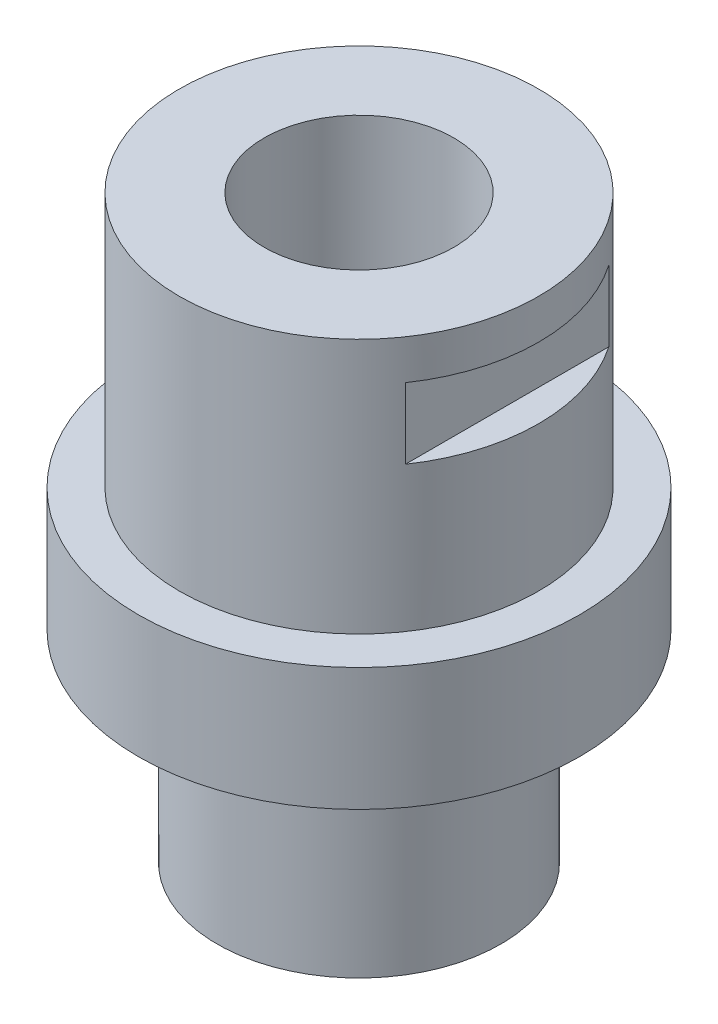
ISO-10303-21;
HEADER;
FILE_DESCRIPTION(('STEP AP214'),'2;1');
FILE_NAME('part.step','',(''),(''),'','','');
FILE_SCHEMA(('AUTOMOTIVE_DESIGN { 1 0 10303 214 1 1 1 1 }'));
ENDSEC;
DATA;
#1=APPLICATION_CONTEXT('core data for automotive mechanical design processes');
#2=APPLICATION_PROTOCOL_DEFINITION('international standard','automotive_design',2000,#1);
#3=PRODUCT_CONTEXT('',#1,'mechanical');
#4=PRODUCT('Part','Part','',(#3));
#5=PRODUCT_RELATED_PRODUCT_CATEGORY('part','',(#4));
#6=PRODUCT_DEFINITION_FORMATION('','',#4);
#7=PRODUCT_DEFINITION_CONTEXT('part definition',#1,'design');
#8=PRODUCT_DEFINITION('design','',#6,#7);
#9=PRODUCT_DEFINITION_SHAPE('','',#8);
#10=(LENGTH_UNIT() NAMED_UNIT(*) SI_UNIT(.MILLI.,.METRE.));
#11=(NAMED_UNIT(*) PLANE_ANGLE_UNIT() SI_UNIT($,.RADIAN.));
#12=(NAMED_UNIT(*) SI_UNIT($,.STERADIAN.) SOLID_ANGLE_UNIT());
#13=UNCERTAINTY_MEASURE_WITH_UNIT(LENGTH_MEASURE(1.E-05),#10,'distance_accuracy_value','');
#14=(GEOMETRIC_REPRESENTATION_CONTEXT(3) GLOBAL_UNCERTAINTY_ASSIGNED_CONTEXT((#13)) GLOBAL_UNIT_ASSIGNED_CONTEXT((#10,
#11,#12)) REPRESENTATION_CONTEXT('',''));
#15=CARTESIAN_POINT('',(0.,0.,0.));
#16=DIRECTION('',(0.,0.,1.));
#17=DIRECTION('',(1.,0.,0.));
#18=AXIS2_PLACEMENT_3D('',#15,#16,#17);
#19=CARTESIAN_POINT('',(0.,51.5,0.));
#20=DIRECTION('',(0.,1.,0.));
#21=DIRECTION('',(0.,0.,1.));
#22=AXIS2_PLACEMENT_3D('',#19,#20,#21);
#23=CYLINDRICAL_SURFACE('',#22,28.5);
#24=CARTESIAN_POINT('',(0.,85.7,0.));
#25=DIRECTION('',(0.,1.,0.));
#26=DIRECTION('',(0.,0.,1.));
#27=AXIS2_PLACEMENT_3D('',#24,#25,#26);
#28=CIRCLE('',#27,28.5);
#29=CARTESIAN_POINT('',(23.5,85.7,-16.1245154965971));
#30=VERTEX_POINT('',#29);
#31=CARTESIAN_POINT('',(23.5,85.7,16.1245154965971));
#32=VERTEX_POINT('',#31);
#33=EDGE_CURVE('E58',#30,#32,#28,.F.);
#34=ORIENTED_EDGE('',*,*,#33,.F.);
#35=DIRECTION('',(0.,1.,0.));
#36=VECTOR('',#35,1.);
#37=CARTESIAN_POINT('',(23.5,51.5,-16.1245154965971));
#38=LINE('',#37,#36);
#39=CARTESIAN_POINT('',(23.5,74.5,-16.1245154965971));
#40=VERTEX_POINT('',#39);
#41=EDGE_CURVE('E95',#40,#30,#38,.T.);
#42=ORIENTED_EDGE('',*,*,#41,.F.);
#43=CARTESIAN_POINT('',(0.,74.5,0.));
#44=DIRECTION('',(0.,-1.,0.));
#45=DIRECTION('',(0.,0.,-1.));
#46=AXIS2_PLACEMENT_3D('',#43,#44,#45);
#47=CIRCLE('',#46,28.5);
#48=CARTESIAN_POINT('',(23.5,74.5,16.1245154965971));
#49=VERTEX_POINT('',#48);
#50=EDGE_CURVE('E98',#49,#40,#47,.F.);
#51=ORIENTED_EDGE('',*,*,#50,.F.);
#52=DIRECTION('',(0.,1.,0.));
#53=VECTOR('',#52,1.);
#54=CARTESIAN_POINT('',(23.5,51.5,16.1245154965971));
#55=LINE('',#54,#53);
#56=EDGE_CURVE('E92',#32,#49,#55,.F.);
#57=ORIENTED_EDGE('',*,*,#56,.F.);
#58=EDGE_LOOP('',(#34,#42,#51,#57));
#59=FACE_BOUND('',#58,.T.);
#60=CARTESIAN_POINT('',(0.,51.5,0.));
#61=DIRECTION('',(0.,1.,0.));
#62=DIRECTION('',(0.,0.,1.));
#63=AXIS2_PLACEMENT_3D('',#60,#61,#62);
#64=CIRCLE('',#63,28.5);
#65=CARTESIAN_POINT('',(0.,51.5,28.5));
#66=VERTEX_POINT('',#65);
#67=EDGE_CURVE('E108',#66,#66,#64,.T.);
#68=ORIENTED_EDGE('',*,*,#67,.T.);
#69=EDGE_LOOP('',(#68));
#70=FACE_BOUND('',#69,.T.);
#71=CARTESIAN_POINT('',(0.,92.,0.));
#72=DIRECTION('',(0.,1.,0.));
#73=DIRECTION('',(0.,0.,1.));
#74=AXIS2_PLACEMENT_3D('',#71,#72,#73);
#75=CIRCLE('',#74,28.5);
#76=CARTESIAN_POINT('',(0.,92.,28.5));
#77=VERTEX_POINT('',#76);
#78=EDGE_CURVE('E104',#77,#77,#75,.T.);
#79=ORIENTED_EDGE('',*,*,#78,.F.);
#80=EDGE_LOOP('',(#79));
#81=FACE_BOUND('',#80,.T.);
#82=DIRECTION('',(0.,1.,0.));
#83=VECTOR('',#82,1.);
#84=CARTESIAN_POINT('',(-23.5,51.5,16.1245154965971));
#85=LINE('',#84,#83);
#86=CARTESIAN_POINT('',(-23.5,85.7,16.1245154965971));
#87=VERTEX_POINT('',#86);
#88=CARTESIAN_POINT('',(-23.5,74.5,16.1245154965971));
#89=VERTEX_POINT('',#88);
#90=EDGE_CURVE('E45',#87,#89,#85,.F.);
#91=ORIENTED_EDGE('',*,*,#90,.T.);
#92=CARTESIAN_POINT('',(0.,74.5,0.));
#93=DIRECTION('',(0.,1.,0.));
#94=DIRECTION('',(0.,0.,1.));
#95=AXIS2_PLACEMENT_3D('',#92,#93,#94);
#96=CIRCLE('',#95,28.5);
#97=CARTESIAN_POINT('',(-23.5,74.5,-16.1245154965971));
#98=VERTEX_POINT('',#97);
#99=EDGE_CURVE('E12',#89,#98,#96,.F.);
#100=ORIENTED_EDGE('',*,*,#99,.T.);
#101=DIRECTION('',(0.,1.,0.));
#102=VECTOR('',#101,1.);
#103=CARTESIAN_POINT('',(-23.5,51.5,-16.1245154965971));
#104=LINE('',#103,#102);
#105=CARTESIAN_POINT('',(-23.5,85.7,-16.1245154965971));
#106=VERTEX_POINT('',#105);
#107=EDGE_CURVE('E81',#98,#106,#104,.T.);
#108=ORIENTED_EDGE('',*,*,#107,.T.);
#109=CARTESIAN_POINT('',(0.,85.7,0.));
#110=DIRECTION('',(0.,-1.,0.));
#111=DIRECTION('',(0.,0.,-1.));
#112=AXIS2_PLACEMENT_3D('',#109,#110,#111);
#113=CIRCLE('',#112,28.5);
#114=EDGE_CURVE('E76',#106,#87,#113,.F.);
#115=ORIENTED_EDGE('',*,*,#114,.T.);
#116=EDGE_LOOP('',(#91,#100,#108,#115));
#117=FACE_BOUND('',#116,.T.);
#118=ADVANCED_FACE('F37',(#59,#70,#81,#117),#23,.T.);
#119=CARTESIAN_POINT('',(0.,92.,0.));
#120=DIRECTION('',(0.,-1.,0.));
#121=DIRECTION('',(0.,0.,-1.));
#122=AXIS2_PLACEMENT_3D('',#119,#120,#121);
#123=CYLINDRICAL_SURFACE('',#122,35.);
#124=CARTESIAN_POINT('',(0.,51.5,0.));
#125=DIRECTION('',(0.,1.,0.));
#126=DIRECTION('',(0.,0.,1.));
#127=AXIS2_PLACEMENT_3D('',#124,#125,#126);
#128=CIRCLE('',#127,35.);
#129=CARTESIAN_POINT('',(0.,51.5,35.));
#130=VERTEX_POINT('',#129);
#131=EDGE_CURVE('E100',#130,#130,#128,.T.);
#132=ORIENTED_EDGE('',*,*,#131,.F.);
#133=EDGE_LOOP('',(#132));
#134=FACE_BOUND('',#133,.T.);
#135=CARTESIAN_POINT('',(0.,32.,0.));
#136=DIRECTION('',(0.,-1.,0.));
#137=DIRECTION('',(0.,0.,-1.));
#138=AXIS2_PLACEMENT_3D('',#135,#136,#137);
#139=CIRCLE('',#138,35.);
#140=CARTESIAN_POINT('',(0.,32.,-35.));
#141=VERTEX_POINT('',#140);
#142=EDGE_CURVE('E101',#141,#141,#139,.T.);
#143=ORIENTED_EDGE('',*,*,#142,.F.);
#144=EDGE_LOOP('',(#143));
#145=FACE_BOUND('',#144,.T.);
#146=ADVANCED_FACE('F39',(#134,#145),#123,.T.);
#147=CARTESIAN_POINT('',(0.,51.5,0.));
#148=DIRECTION('',(0.,1.,0.));
#149=DIRECTION('',(0.,0.,1.));
#150=AXIS2_PLACEMENT_3D('',#147,#148,#149);
#151=PLANE('',#150);
#152=ORIENTED_EDGE('',*,*,#67,.F.);
#153=EDGE_LOOP('',(#152));
#154=FACE_BOUND('',#153,.T.);
#155=ORIENTED_EDGE('',*,*,#131,.T.);
#156=EDGE_LOOP('',(#155));
#157=FACE_BOUND('',#156,.T.);
#158=ADVANCED_FACE('F146',(#154,#157),#151,.T.);
#159=CARTESIAN_POINT('',(0.,92.,0.));
#160=DIRECTION('',(0.,1.,0.));
#161=DIRECTION('',(0.,0.,1.));
#162=AXIS2_PLACEMENT_3D('',#159,#160,#161);
#163=PLANE('',#162);
#164=CARTESIAN_POINT('',(0.,92.,0.));
#165=DIRECTION('',(0.,-1.,0.));
#166=DIRECTION('',(0.,0.,-1.));
#167=AXIS2_PLACEMENT_3D('',#164,#165,#166);
#168=CIRCLE('',#167,15.05);
#169=CARTESIAN_POINT('',(0.,92.,-15.05));
#170=VERTEX_POINT('',#169);
#171=EDGE_CURVE('E116',#170,#170,#168,.T.);
#172=ORIENTED_EDGE('',*,*,#171,.T.);
#173=EDGE_LOOP('',(#172));
#174=FACE_BOUND('',#173,.T.);
#175=ORIENTED_EDGE('',*,*,#78,.T.);
#176=EDGE_LOOP('',(#175));
#177=FACE_BOUND('',#176,.T.);
#178=ADVANCED_FACE('F155',(#174,#177),#163,.T.);
#179=CARTESIAN_POINT('',(0.,32.,0.));
#180=DIRECTION('',(0.,-1.,0.));
#181=DIRECTION('',(0.,0.,-1.));
#182=AXIS2_PLACEMENT_3D('',#179,#180,#181);
#183=PLANE('',#182);
#184=CARTESIAN_POINT('',(0.,32.,0.));
#185=DIRECTION('',(0.,-1.,0.));
#186=DIRECTION('',(0.,0.,-1.));
#187=AXIS2_PLACEMENT_3D('',#184,#185,#186);
#188=CIRCLE('',#187,22.5);
#189=CARTESIAN_POINT('',(0.,32.,-22.5));
#190=VERTEX_POINT('',#189);
#191=EDGE_CURVE('E105',#190,#190,#188,.T.);
#192=ORIENTED_EDGE('',*,*,#191,.F.);
#193=EDGE_LOOP('',(#192));
#194=FACE_BOUND('',#193,.T.);
#195=ORIENTED_EDGE('',*,*,#142,.T.);
#196=EDGE_LOOP('',(#195));
#197=FACE_BOUND('',#196,.T.);
#198=ADVANCED_FACE('F151',(#194,#197),#183,.T.);
#199=CARTESIAN_POINT('',(0.,32.,0.));
#200=DIRECTION('',(0.,-1.,0.));
#201=DIRECTION('',(0.,0.,-1.));
#202=AXIS2_PLACEMENT_3D('',#199,#200,#201);
#203=CYLINDRICAL_SURFACE('',#202,22.5);
#204=ORIENTED_EDGE('',*,*,#191,.T.);
#205=EDGE_LOOP('',(#204));
#206=FACE_BOUND('',#205,.T.);
#207=CARTESIAN_POINT('',(0.,0.,0.));
#208=DIRECTION('',(0.,-1.,0.));
#209=DIRECTION('',(0.,0.,-1.));
#210=AXIS2_PLACEMENT_3D('',#207,#208,#209);
#211=CIRCLE('',#210,22.5);
#212=CARTESIAN_POINT('',(0.,0.,-22.5));
#213=VERTEX_POINT('',#212);
#214=EDGE_CURVE('E113',#213,#213,#211,.T.);
#215=ORIENTED_EDGE('',*,*,#214,.F.);
#216=EDGE_LOOP('',(#215));
#217=FACE_BOUND('',#216,.T.);
#218=ADVANCED_FACE('F162',(#206,#217),#203,.T.);
#219=CARTESIAN_POINT('',(0.,0.,0.));
#220=DIRECTION('',(0.,1.,0.));
#221=DIRECTION('',(0.,0.,1.));
#222=AXIS2_PLACEMENT_3D('',#219,#220,#221);
#223=PLANE('',#222);
#224=CARTESIAN_POINT('',(0.,0.,0.));
#225=DIRECTION('',(0.,-1.,0.));
#226=DIRECTION('',(0.,0.,-1.));
#227=AXIS2_PLACEMENT_3D('',#224,#225,#226);
#228=CIRCLE('',#227,15.05);
#229=CARTESIAN_POINT('',(0.,0.,-15.05));
#230=VERTEX_POINT('',#229);
#231=EDGE_CURVE('E119',#230,#230,#228,.T.);
#232=ORIENTED_EDGE('',*,*,#231,.F.);
#233=EDGE_LOOP('',(#232));
#234=FACE_BOUND('',#233,.T.);
#235=ORIENTED_EDGE('',*,*,#214,.T.);
#236=EDGE_LOOP('',(#235));
#237=FACE_BOUND('',#236,.T.);
#238=ADVANCED_FACE('F159',(#234,#237),#223,.F.);
#239=CARTESIAN_POINT('',(0.,92.,0.));
#240=DIRECTION('',(0.,-1.,0.));
#241=DIRECTION('',(0.,0.,-1.));
#242=AXIS2_PLACEMENT_3D('',#239,#240,#241);
#243=CYLINDRICAL_SURFACE('',#242,15.05);
#244=ORIENTED_EDGE('',*,*,#171,.F.);
#245=EDGE_LOOP('',(#244));
#246=FACE_BOUND('',#245,.T.);
#247=ORIENTED_EDGE('',*,*,#231,.T.);
#248=EDGE_LOOP('',(#247));
#249=FACE_BOUND('',#248,.T.);
#250=ADVANCED_FACE('F161',(#246,#249),#243,.F.);
#251=CARTESIAN_POINT('',(23.5,85.7,-35.));
#252=DIRECTION('',(-1.,0.,0.));
#253=DIRECTION('',(0.,0.,1.));
#254=AXIS2_PLACEMENT_3D('',#251,#252,#253);
#255=PLANE('',#254);
#256=ORIENTED_EDGE('',*,*,#56,.T.);
#257=DIRECTION('',(0.,0.,1.));
#258=VECTOR('',#257,1.);
#259=CARTESIAN_POINT('',(23.5,74.5,-35.));
#260=LINE('',#259,#258);
#261=EDGE_CURVE('E125',#40,#49,#260,.T.);
#262=ORIENTED_EDGE('',*,*,#261,.F.);
#263=ORIENTED_EDGE('',*,*,#41,.T.);
#264=DIRECTION('',(0.,0.,1.));
#265=VECTOR('',#264,1.);
#266=CARTESIAN_POINT('',(23.5,85.7,-35.));
#267=LINE('',#266,#265);
#268=EDGE_CURVE('E122',#30,#32,#267,.T.);
#269=ORIENTED_EDGE('',*,*,#268,.T.);
#270=EDGE_LOOP('',(#256,#262,#263,#269));
#271=FACE_BOUND('',#270,.T.);
#272=ADVANCED_FACE('F168',(#271),#255,.F.);
#273=CARTESIAN_POINT('',(23.5,85.7,-35.));
#274=DIRECTION('',(0.,1.,0.));
#275=DIRECTION('',(0.,0.,1.));
#276=AXIS2_PLACEMENT_3D('',#273,#274,#275);
#277=PLANE('',#276);
#278=ORIENTED_EDGE('',*,*,#268,.F.);
#279=ORIENTED_EDGE('',*,*,#33,.T.);
#280=EDGE_LOOP('',(#278,#279));
#281=FACE_BOUND('',#280,.T.);
#282=ADVANCED_FACE('F184',(#281),#277,.F.);
#283=CARTESIAN_POINT('',(23.5,74.5,-35.));
#284=DIRECTION('',(0.,-1.,0.));
#285=DIRECTION('',(0.,0.,-1.));
#286=AXIS2_PLACEMENT_3D('',#283,#284,#285);
#287=PLANE('',#286);
#288=ORIENTED_EDGE('',*,*,#261,.T.);
#289=ORIENTED_EDGE('',*,*,#50,.T.);
#290=EDGE_LOOP('',(#288,#289));
#291=FACE_BOUND('',#290,.T.);
#292=ADVANCED_FACE('F138',(#291),#287,.F.);
#293=CARTESIAN_POINT('',(-23.5,85.7,-35.));
#294=DIRECTION('',(-1.,0.,0.));
#295=DIRECTION('',(0.,0.,1.));
#296=AXIS2_PLACEMENT_3D('',#293,#294,#295);
#297=PLANE('',#296);
#298=DIRECTION('',(0.,0.,1.));
#299=VECTOR('',#298,1.);
#300=CARTESIAN_POINT('',(-23.5,85.7,-35.));
#301=LINE('',#300,#299);
#302=EDGE_CURVE('E51',#106,#87,#301,.T.);
#303=ORIENTED_EDGE('',*,*,#302,.F.);
#304=ORIENTED_EDGE('',*,*,#107,.F.);
#305=DIRECTION('',(0.,0.,1.));
#306=VECTOR('',#305,1.);
#307=CARTESIAN_POINT('',(-23.5,74.5,-35.));
#308=LINE('',#307,#306);
#309=EDGE_CURVE('E87',#98,#89,#308,.T.);
#310=ORIENTED_EDGE('',*,*,#309,.T.);
#311=ORIENTED_EDGE('',*,*,#90,.F.);
#312=EDGE_LOOP('',(#303,#304,#310,#311));
#313=FACE_BOUND('',#312,.T.);
#314=ADVANCED_FACE('F84',(#313),#297,.T.);
#315=CARTESIAN_POINT('',(-23.5,74.5,-35.));
#316=DIRECTION('',(0.,1.,0.));
#317=DIRECTION('',(0.,0.,1.));
#318=AXIS2_PLACEMENT_3D('',#315,#316,#317);
#319=PLANE('',#318);
#320=ORIENTED_EDGE('',*,*,#309,.F.);
#321=ORIENTED_EDGE('',*,*,#99,.F.);
#322=EDGE_LOOP('',(#320,#321));
#323=FACE_BOUND('',#322,.T.);
#324=ADVANCED_FACE('F130',(#323),#319,.T.);
#325=CARTESIAN_POINT('',(-23.5,85.7,-35.));
#326=DIRECTION('',(0.,-1.,0.));
#327=DIRECTION('',(0.,0.,-1.));
#328=AXIS2_PLACEMENT_3D('',#325,#326,#327);
#329=PLANE('',#328);
#330=ORIENTED_EDGE('',*,*,#302,.T.);
#331=ORIENTED_EDGE('',*,*,#114,.F.);
#332=EDGE_LOOP('',(#330,#331));
#333=FACE_BOUND('',#332,.T.);
#334=ADVANCED_FACE('F77',(#333),#329,.T.);
#335=CLOSED_SHELL('',(#118,#146,#158,#178,#198,#218,#238,#250,#272,#282,#292,#314,#324,#334));
#336=MANIFOLD_SOLID_BREP('B2',#335);
#337=ADVANCED_BREP_SHAPE_REPRESENTATION('',(#18,#336),#14);
#338=SHAPE_DEFINITION_REPRESENTATION(#9,#337);
ENDSEC;
END-ISO-10303-21;
